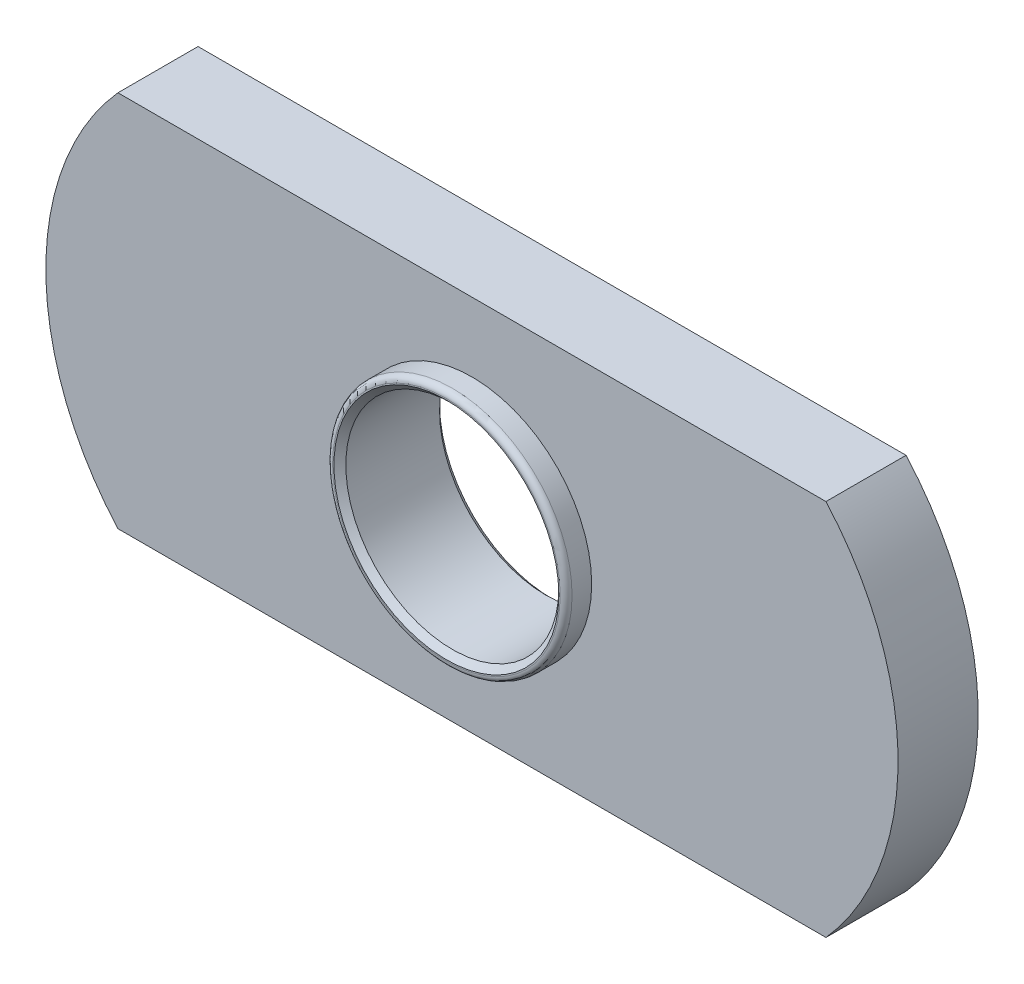
ISO-10303-21;
HEADER;
FILE_DESCRIPTION(('STEP AP214'),'2;1');
FILE_NAME('part.step','',(''),(''),'','','');
FILE_SCHEMA(('AUTOMOTIVE_DESIGN { 1 0 10303 214 1 1 1 1 }'));
ENDSEC;
DATA;
#1=APPLICATION_CONTEXT('core data for automotive mechanical design processes');
#2=APPLICATION_PROTOCOL_DEFINITION('international standard','automotive_design',2000,#1);
#3=PRODUCT_CONTEXT('',#1,'mechanical');
#4=PRODUCT('Part','Part','',(#3));
#5=PRODUCT_RELATED_PRODUCT_CATEGORY('part','',(#4));
#6=PRODUCT_DEFINITION_FORMATION('','',#4);
#7=PRODUCT_DEFINITION_CONTEXT('part definition',#1,'design');
#8=PRODUCT_DEFINITION('design','',#6,#7);
#9=PRODUCT_DEFINITION_SHAPE('','',#8);
#10=(LENGTH_UNIT() NAMED_UNIT(*) SI_UNIT(.MILLI.,.METRE.));
#11=(NAMED_UNIT(*) PLANE_ANGLE_UNIT() SI_UNIT($,.RADIAN.));
#12=(NAMED_UNIT(*) SI_UNIT($,.STERADIAN.) SOLID_ANGLE_UNIT());
#13=UNCERTAINTY_MEASURE_WITH_UNIT(LENGTH_MEASURE(1.E-05),#10,'distance_accuracy_value','');
#14=(GEOMETRIC_REPRESENTATION_CONTEXT(3) GLOBAL_UNCERTAINTY_ASSIGNED_CONTEXT((#13)) GLOBAL_UNIT_ASSIGNED_CONTEXT((#10,
#11,#12)) REPRESENTATION_CONTEXT('',''));
#15=CARTESIAN_POINT('',(0.,0.,0.));
#16=DIRECTION('',(0.,0.,1.));
#17=DIRECTION('',(1.,0.,0.));
#18=AXIS2_PLACEMENT_3D('',#15,#16,#17);
#19=CARTESIAN_POINT('',(0.,0.,2.972435));
#20=DIRECTION('',(0.,0.,1.));
#21=DIRECTION('',(0.,1.,0.));
#22=AXIS2_PLACEMENT_3D('',#19,#20,#21);
#23=TOROIDAL_SURFACE('',#22,3.391535,0.177165);
#24=CARTESIAN_POINT('',(0.,0.,2.972435));
#25=DIRECTION('',(0.,0.,1.));
#26=DIRECTION('',(1.,0.,0.));
#27=AXIS2_PLACEMENT_3D('',#24,#25,#26);
#28=CIRCLE('',#27,3.5687);
#29=CARTESIAN_POINT('',(3.5687,0.,2.972435));
#30=VERTEX_POINT('',#29);
#31=EDGE_CURVE('E80',#30,#30,#28,.F.);
#32=ORIENTED_EDGE('',*,*,#31,.F.);
#33=EDGE_LOOP('',(#32));
#34=FACE_BOUND('',#33,.T.);
#35=CARTESIAN_POINT('',(0.,0.,3.1496));
#36=DIRECTION('',(0.,0.,-1.));
#37=DIRECTION('',(0.,-1.,0.));
#38=AXIS2_PLACEMENT_3D('',#35,#36,#37);
#39=CIRCLE('',#38,3.391535);
#40=CARTESIAN_POINT('',(0.,3.391535,3.1496));
#41=VERTEX_POINT('',#40);
#42=CARTESIAN_POINT('',(0.,-3.391535,3.1496));
#43=VERTEX_POINT('',#42);
#44=EDGE_CURVE('E72',#41,#43,#39,.F.);
#45=ORIENTED_EDGE('',*,*,#44,.F.);
#46=CARTESIAN_POINT('',(0.,0.,3.1496));
#47=DIRECTION('',(0.,0.,-1.));
#48=DIRECTION('',(0.,1.,0.));
#49=AXIS2_PLACEMENT_3D('',#46,#47,#48);
#50=CIRCLE('',#49,3.391535);
#51=EDGE_CURVE('E75',#43,#41,#50,.F.);
#52=ORIENTED_EDGE('',*,*,#51,.F.);
#53=EDGE_LOOP('',(#45,#52));
#54=FACE_BOUND('',#53,.T.);
#55=ADVANCED_FACE('F16',(#34,#54),#23,.T.);
#56=CARTESIAN_POINT('',(0.,0.,3.1496));
#57=DIRECTION('',(0.,0.,1.));
#58=DIRECTION('',(1.,0.,0.));
#59=AXIS2_PLACEMENT_3D('',#56,#57,#58);
#60=PLANE('',#59);
#61=CARTESIAN_POINT('',(0.,0.,3.14960000002884));
#62=DIRECTION('',(0.,0.,1.));
#63=DIRECTION('',(1.,0.,0.));
#64=AXIS2_PLACEMENT_3D('',#61,#62,#63);
#65=CIRCLE('',#64,3.35216500002389);
#66=CARTESIAN_POINT('',(3.35216500002389,0.,3.14960000002884));
#67=VERTEX_POINT('',#66);
#68=EDGE_CURVE('E117',#67,#67,#65,.F.);
#69=ORIENTED_EDGE('',*,*,#68,.T.);
#70=EDGE_LOOP('',(#69));
#71=FACE_BOUND('',#70,.T.);
#72=ORIENTED_EDGE('',*,*,#44,.T.);
#73=ORIENTED_EDGE('',*,*,#51,.T.);
#74=EDGE_LOOP('',(#72,#73));
#75=FACE_BOUND('',#74,.T.);
#76=ADVANCED_FACE('F77',(#71,#75),#60,.T.);
#77=CARTESIAN_POINT('',(0.,0.,-0.15748));
#78=DIRECTION('',(0.,0.,1.));
#79=DIRECTION('',(1.,0.,0.));
#80=AXIS2_PLACEMENT_3D('',#77,#78,#79);
#81=CYLINDRICAL_SURFACE('',#80,3.5687);
#82=CARTESIAN_POINT('',(0.,0.,2.3876));
#83=DIRECTION('',(0.,0.,1.));
#84=DIRECTION('',(1.,0.,0.));
#85=AXIS2_PLACEMENT_3D('',#82,#83,#84);
#86=CIRCLE('',#85,3.5687);
#87=CARTESIAN_POINT('',(3.5687,0.,2.3876));
#88=VERTEX_POINT('',#87);
#89=EDGE_CURVE('E112',#88,#88,#86,.F.);
#90=ORIENTED_EDGE('',*,*,#89,.F.);
#91=EDGE_LOOP('',(#90));
#92=FACE_BOUND('',#91,.T.);
#93=ORIENTED_EDGE('',*,*,#31,.T.);
#94=EDGE_LOOP('',(#93));
#95=FACE_BOUND('',#94,.T.);
#96=ADVANCED_FACE('F137',(#92,#95),#81,.T.);
#97=CARTESIAN_POINT('',(0.,0.,3.149599999972));
#98=DIRECTION('',(0.,0.,1.));
#99=DIRECTION('',(1.,0.,0.));
#100=AXIS2_PLACEMENT_3D('',#97,#98,#99);
#101=CONICAL_SURFACE('',#100,3.35216499996704,0.785398163397448);
#102=ORIENTED_EDGE('',*,*,#68,.F.);
#103=EDGE_LOOP('',(#102));
#104=FACE_BOUND('',#103,.T.);
#105=CARTESIAN_POINT('',(0.,0.,2.972435));
#106=DIRECTION('',(0.,0.,1.));
#107=DIRECTION('',(1.,0.,0.));
#108=AXIS2_PLACEMENT_3D('',#105,#106,#107);
#109=CIRCLE('',#108,3.175);
#110=CARTESIAN_POINT('',(3.175,0.,2.972435));
#111=VERTEX_POINT('',#110);
#112=EDGE_CURVE('E116',#111,#111,#109,.F.);
#113=ORIENTED_EDGE('',*,*,#112,.T.);
#114=EDGE_LOOP('',(#113));
#115=FACE_BOUND('',#114,.T.);
#116=ADVANCED_FACE('F259',(#104,#115),#101,.F.);
#117=CARTESIAN_POINT('',(0.,0.,2.3876));
#118=DIRECTION('',(0.,0.,1.));
#119=DIRECTION('',(1.,0.,0.));
#120=AXIS2_PLACEMENT_3D('',#117,#118,#119);
#121=PLANE('',#120);
#122=ORIENTED_EDGE('',*,*,#89,.T.);
#123=EDGE_LOOP('',(#122));
#124=FACE_BOUND('',#123,.T.);
#125=CARTESIAN_POINT('',(-4.26085,0.,2.3876));
#126=DIRECTION('',(0.,0.,1.));
#127=DIRECTION('',(1.,0.,0.));
#128=AXIS2_PLACEMENT_3D('',#125,#126,#127);
#129=CIRCLE('',#128,8.43915);
#130=CARTESIAN_POINT('',(-10.5510210241058,-5.6261,2.3876));
#131=VERTEX_POINT('',#130);
#132=CARTESIAN_POINT('',(-10.5510210241058,5.62610000000001,2.3876));
#133=VERTEX_POINT('',#132);
#134=EDGE_CURVE('E66',#131,#133,#129,.F.);
#135=ORIENTED_EDGE('',*,*,#134,.F.);
#136=DIRECTION('',(1.,0.,0.));
#137=VECTOR('',#136,1.);
#138=CARTESIAN_POINT('',(-10.5510210241057,-5.6261,2.3876));
#139=LINE('',#138,#137);
#140=CARTESIAN_POINT('',(10.5510210241058,-5.62610000000001,2.3876));
#141=VERTEX_POINT('',#140);
#142=EDGE_CURVE('E60',#141,#131,#139,.F.);
#143=ORIENTED_EDGE('',*,*,#142,.F.);
#144=CARTESIAN_POINT('',(4.26085,0.,2.3876));
#145=DIRECTION('',(0.,0.,1.));
#146=DIRECTION('',(1.,0.,0.));
#147=AXIS2_PLACEMENT_3D('',#144,#145,#146);
#148=CIRCLE('',#147,8.43915);
#149=CARTESIAN_POINT('',(10.5510210241058,5.62610000000001,2.3876));
#150=VERTEX_POINT('',#149);
#151=EDGE_CURVE('E104',#150,#141,#148,.F.);
#152=ORIENTED_EDGE('',*,*,#151,.F.);
#153=DIRECTION('',(1.,0.,0.));
#154=VECTOR('',#153,1.);
#155=CARTESIAN_POINT('',(10.5510210241057,5.6261,2.3876));
#156=LINE('',#155,#154);
#157=EDGE_CURVE('E111',#133,#150,#156,.T.);
#158=ORIENTED_EDGE('',*,*,#157,.F.);
#159=EDGE_LOOP('',(#135,#143,#152,#158));
#160=FACE_BOUND('',#159,.T.);
#161=ADVANCED_FACE('F249',(#124,#160),#121,.T.);
#162=CARTESIAN_POINT('',(0.,0.,-0.15748));
#163=DIRECTION('',(0.,0.,1.));
#164=DIRECTION('',(1.,0.,0.));
#165=AXIS2_PLACEMENT_3D('',#162,#163,#164);
#166=CYLINDRICAL_SURFACE('',#165,3.175);
#167=ORIENTED_EDGE('',*,*,#112,.F.);
#168=EDGE_LOOP('',(#167));
#169=FACE_BOUND('',#168,.T.);
#170=CARTESIAN_POINT('',(0.,0.,0.177164999911383));
#171=DIRECTION('',(0.,0.,-1.));
#172=DIRECTION('',(0.,-1.,0.));
#173=AXIS2_PLACEMENT_3D('',#170,#171,#172);
#174=CIRCLE('',#173,3.17500000005566);
#175=CARTESIAN_POINT('',(0.,-3.17500000005566,0.177164999911383));
#176=VERTEX_POINT('',#175);
#177=EDGE_CURVE('E156',#176,#176,#174,.T.);
#178=ORIENTED_EDGE('',*,*,#177,.T.);
#179=EDGE_LOOP('',(#178));
#180=FACE_BOUND('',#179,.T.);
#181=ADVANCED_FACE('F240',(#169,#180),#166,.F.);
#182=CARTESIAN_POINT('',(10.5510210241057,5.6261,0.));
#183=DIRECTION('',(0.,1.,0.));
#184=DIRECTION('',(0.,0.,1.));
#185=AXIS2_PLACEMENT_3D('',#182,#183,#184);
#186=PLANE('',#185);
#187=DIRECTION('',(0.,0.,1.));
#188=VECTOR('',#187,1.);
#189=CARTESIAN_POINT('',(10.5510210241058,5.62610000000002,0.));
#190=LINE('',#189,#188);
#191=CARTESIAN_POINT('',(10.5510210241058,5.62610000000001,0.));
#192=VERTEX_POINT('',#191);
#193=EDGE_CURVE('E107',#192,#150,#190,.T.);
#194=ORIENTED_EDGE('',*,*,#193,.F.);
#195=DIRECTION('',(1.,0.,0.));
#196=VECTOR('',#195,1.);
#197=CARTESIAN_POINT('',(0.,5.6261,0.));
#198=LINE('',#197,#196);
#199=CARTESIAN_POINT('',(-10.5510210241058,5.62610000000001,0.));
#200=VERTEX_POINT('',#199);
#201=EDGE_CURVE('E103',#192,#200,#198,.F.);
#202=ORIENTED_EDGE('',*,*,#201,.T.);
#203=DIRECTION('',(0.,0.,1.));
#204=VECTOR('',#203,1.);
#205=CARTESIAN_POINT('',(-10.5510210241058,5.62610000000002,0.));
#206=LINE('',#205,#204);
#207=EDGE_CURVE('E110',#133,#200,#206,.F.);
#208=ORIENTED_EDGE('',*,*,#207,.F.);
#209=ORIENTED_EDGE('',*,*,#157,.T.);
#210=EDGE_LOOP('',(#194,#202,#208,#209));
#211=FACE_BOUND('',#210,.T.);
#212=ADVANCED_FACE('F183',(#211),#186,.T.);
#213=CARTESIAN_POINT('',(-4.26085,0.,0.));
#214=DIRECTION('',(0.,0.,1.));
#215=DIRECTION('',(1.,0.,0.));
#216=AXIS2_PLACEMENT_3D('',#213,#214,#215);
#217=CYLINDRICAL_SURFACE('',#216,8.43915);
#218=ORIENTED_EDGE('',*,*,#207,.T.);
#219=CARTESIAN_POINT('',(-4.26085,0.,0.));
#220=DIRECTION('',(0.,0.,1.));
#221=DIRECTION('',(1.,0.,0.));
#222=AXIS2_PLACEMENT_3D('',#219,#220,#221);
#223=CIRCLE('',#222,8.43915);
#224=CARTESIAN_POINT('',(-10.5510210241058,-5.6261,0.));
#225=VERTEX_POINT('',#224);
#226=EDGE_CURVE('E99',#200,#225,#223,.T.);
#227=ORIENTED_EDGE('',*,*,#226,.T.);
#228=DIRECTION('',(0.,0.,-1.));
#229=VECTOR('',#228,1.);
#230=CARTESIAN_POINT('',(-10.5510210241057,-5.6261,0.));
#231=LINE('',#230,#229);
#232=EDGE_CURVE('E155',#131,#225,#231,.T.);
#233=ORIENTED_EDGE('',*,*,#232,.F.);
#234=ORIENTED_EDGE('',*,*,#134,.T.);
#235=EDGE_LOOP('',(#218,#227,#233,#234));
#236=FACE_BOUND('',#235,.T.);
#237=ADVANCED_FACE('F179',(#236),#217,.T.);
#238=CARTESIAN_POINT('',(-10.5510210241057,-5.6261,0.));
#239=DIRECTION('',(0.,-1.,0.));
#240=DIRECTION('',(0.,0.,-1.));
#241=AXIS2_PLACEMENT_3D('',#238,#239,#240);
#242=PLANE('',#241);
#243=ORIENTED_EDGE('',*,*,#232,.T.);
#244=DIRECTION('',(1.,0.,0.));
#245=VECTOR('',#244,1.);
#246=CARTESIAN_POINT('',(0.,-5.6261,0.));
#247=LINE('',#246,#245);
#248=CARTESIAN_POINT('',(10.5510210241058,-5.62610000000001,0.));
#249=VERTEX_POINT('',#248);
#250=EDGE_CURVE('E98',#225,#249,#247,.T.);
#251=ORIENTED_EDGE('',*,*,#250,.T.);
#252=DIRECTION('',(0.,0.,1.));
#253=VECTOR('',#252,1.);
#254=CARTESIAN_POINT('',(10.5510210241058,-5.62610000000002,0.));
#255=LINE('',#254,#253);
#256=EDGE_CURVE('E38',#141,#249,#255,.F.);
#257=ORIENTED_EDGE('',*,*,#256,.F.);
#258=ORIENTED_EDGE('',*,*,#142,.T.);
#259=EDGE_LOOP('',(#243,#251,#257,#258));
#260=FACE_BOUND('',#259,.T.);
#261=ADVANCED_FACE('F175',(#260),#242,.T.);
#262=CARTESIAN_POINT('',(4.26085,0.,0.));
#263=DIRECTION('',(0.,0.,1.));
#264=DIRECTION('',(1.,0.,0.));
#265=AXIS2_PLACEMENT_3D('',#262,#263,#264);
#266=CYLINDRICAL_SURFACE('',#265,8.43915);
#267=ORIENTED_EDGE('',*,*,#256,.T.);
#268=CARTESIAN_POINT('',(4.26085,0.,0.));
#269=DIRECTION('',(0.,0.,1.));
#270=DIRECTION('',(1.,0.,0.));
#271=AXIS2_PLACEMENT_3D('',#268,#269,#270);
#272=CIRCLE('',#271,8.43915);
#273=EDGE_CURVE('E29',#249,#192,#272,.T.);
#274=ORIENTED_EDGE('',*,*,#273,.T.);
#275=ORIENTED_EDGE('',*,*,#193,.T.);
#276=ORIENTED_EDGE('',*,*,#151,.T.);
#277=EDGE_LOOP('',(#267,#274,#275,#276));
#278=FACE_BOUND('',#277,.T.);
#279=ADVANCED_FACE('F185',(#278),#266,.T.);
#280=CARTESIAN_POINT('',(0.,0.,0.));
#281=DIRECTION('',(0.,0.,-1.));
#282=DIRECTION('',(-1.,0.,0.));
#283=AXIS2_PLACEMENT_3D('',#280,#281,#282);
#284=CONICAL_SURFACE('',#283,3.35216499996704,0.785398163397448);
#285=ORIENTED_EDGE('',*,*,#177,.F.);
#286=EDGE_LOOP('',(#285));
#287=FACE_BOUND('',#286,.T.);
#288=CARTESIAN_POINT('',(0.,0.,-5.6843418860808E-11));
#289=DIRECTION('',(0.,0.,-1.));
#290=DIRECTION('',(-1.,0.,0.));
#291=AXIS2_PLACEMENT_3D('',#288,#289,#290);
#292=CIRCLE('',#291,3.35216500002389);
#293=CARTESIAN_POINT('',(-3.35216500002389,0.,-5.6843418860808E-11));
#294=VERTEX_POINT('',#293);
#295=EDGE_CURVE('E11',#294,#294,#292,.T.);
#296=ORIENTED_EDGE('',*,*,#295,.T.);
#297=EDGE_LOOP('',(#296));
#298=FACE_BOUND('',#297,.T.);
#299=ADVANCED_FACE('F187',(#287,#298),#284,.F.);
#300=CARTESIAN_POINT('',(0.,0.,0.));
#301=DIRECTION('',(0.,0.,1.));
#302=DIRECTION('',(1.,0.,0.));
#303=AXIS2_PLACEMENT_3D('',#300,#301,#302);
#304=PLANE('',#303);
#305=ORIENTED_EDGE('',*,*,#295,.F.);
#306=EDGE_LOOP('',(#305));
#307=FACE_BOUND('',#306,.T.);
#308=ORIENTED_EDGE('',*,*,#250,.F.);
#309=ORIENTED_EDGE('',*,*,#226,.F.);
#310=ORIENTED_EDGE('',*,*,#201,.F.);
#311=ORIENTED_EDGE('',*,*,#273,.F.);
#312=EDGE_LOOP('',(#308,#309,#310,#311));
#313=FACE_BOUND('',#312,.T.);
#314=ADVANCED_FACE('F178',(#307,#313),#304,.F.);
#315=CLOSED_SHELL('',(#55,#76,#96,#116,#161,#181,#212,#237,#261,#279,#299,#314));
#316=MANIFOLD_SOLID_BREP('B1',#315);
#317=ADVANCED_BREP_SHAPE_REPRESENTATION('',(#18,#316),#14);
#318=SHAPE_DEFINITION_REPRESENTATION(#9,#317);
ENDSEC;
END-ISO-10303-21;
